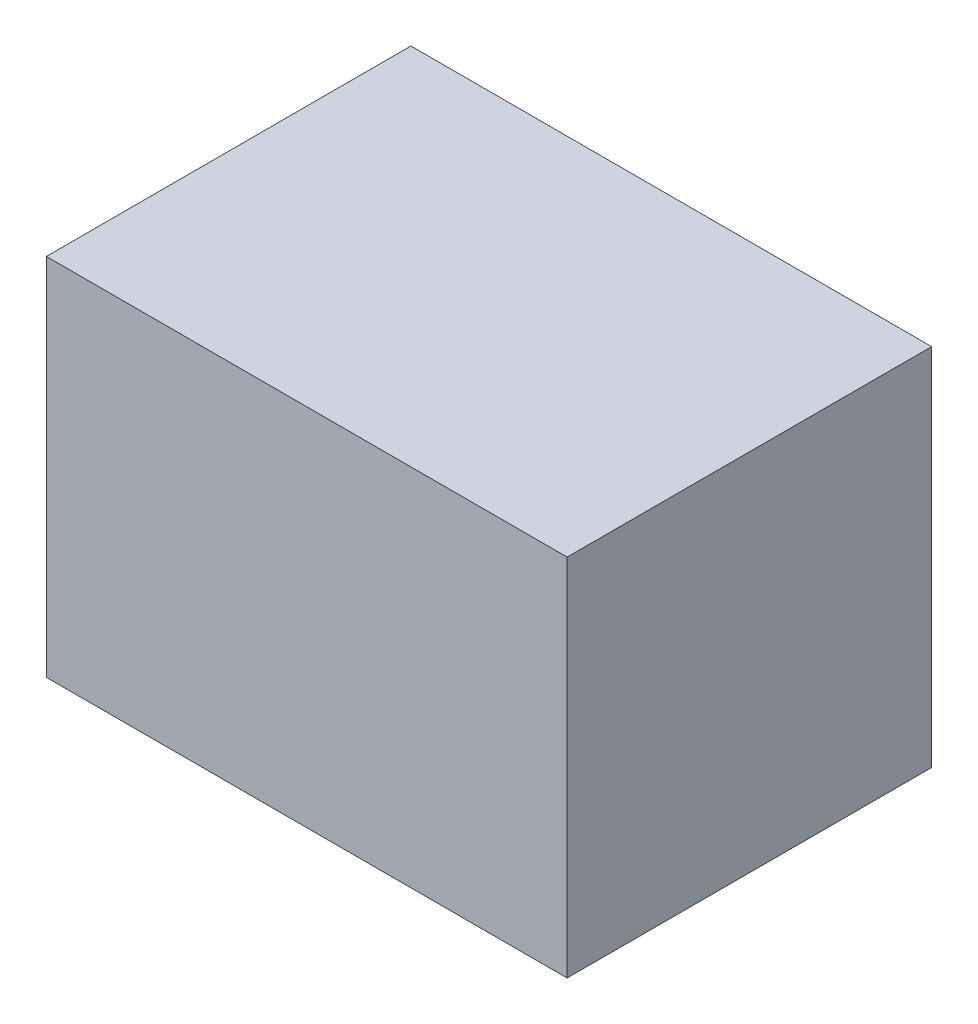
ISO-10303-21;
HEADER;
FILE_DESCRIPTION(('STEP AP214'),'2;1');
FILE_NAME('part.step','',(''),(''),'','','');
FILE_SCHEMA(('AUTOMOTIVE_DESIGN { 1 0 10303 214 1 1 1 1 }'));
ENDSEC;
DATA;
#1=APPLICATION_CONTEXT('core data for automotive mechanical design processes');
#2=APPLICATION_PROTOCOL_DEFINITION('international standard','automotive_design',2000,#1);
#3=PRODUCT_CONTEXT('',#1,'mechanical');
#4=PRODUCT('Part','Part','',(#3));
#5=PRODUCT_RELATED_PRODUCT_CATEGORY('part','',(#4));
#6=PRODUCT_DEFINITION_FORMATION('','',#4);
#7=PRODUCT_DEFINITION_CONTEXT('part definition',#1,'design');
#8=PRODUCT_DEFINITION('design','',#6,#7);
#9=PRODUCT_DEFINITION_SHAPE('','',#8);
#10=(LENGTH_UNIT() NAMED_UNIT(*) SI_UNIT(.MILLI.,.METRE.));
#11=(NAMED_UNIT(*) PLANE_ANGLE_UNIT() SI_UNIT($,.RADIAN.));
#12=(NAMED_UNIT(*) SI_UNIT($,.STERADIAN.) SOLID_ANGLE_UNIT());
#13=UNCERTAINTY_MEASURE_WITH_UNIT(LENGTH_MEASURE(1.E-05),#10,'distance_accuracy_value','');
#14=(GEOMETRIC_REPRESENTATION_CONTEXT(3) GLOBAL_UNCERTAINTY_ASSIGNED_CONTEXT((#13)) GLOBAL_UNIT_ASSIGNED_CONTEXT((#10,
#11,#12)) REPRESENTATION_CONTEXT('',''));
#15=CARTESIAN_POINT('',(0.,0.,0.));
#16=DIRECTION('',(0.,0.,1.));
#17=DIRECTION('',(1.,0.,0.));
#18=AXIS2_PLACEMENT_3D('',#15,#16,#17);
#19=CARTESIAN_POINT('',(-7.62,0.,0.));
#20=DIRECTION('',(0.,1.,0.));
#21=DIRECTION('',(1.,0.,0.));
#22=AXIS2_PLACEMENT_3D('',#19,#20,#21);
#23=PLANE('',#22);
#24=DIRECTION('',(0.,0.,1.));
#25=VECTOR('',#24,1.);
#26=CARTESIAN_POINT('',(7.37,0.,0.749999999999982));
#27=LINE('',#26,#25);
#28=CARTESIAN_POINT('',(7.37,0.,0.749999999999982));
#29=VERTEX_POINT('',#28);
#30=CARTESIAN_POINT('',(7.37,0.,1.1));
#31=VERTEX_POINT('',#30);
#32=EDGE_CURVE('E85',#29,#31,#27,.T.);
#33=ORIENTED_EDGE('',*,*,#32,.T.);
#34=DIRECTION('',(1.,0.,0.));
#35=VECTOR('',#34,1.);
#36=CARTESIAN_POINT('',(7.37,0.,1.1));
#37=LINE('',#36,#35);
#38=CARTESIAN_POINT('',(7.87,0.,1.1));
#39=VERTEX_POINT('',#38);
#40=EDGE_CURVE('E27',#31,#39,#37,.T.);
#41=ORIENTED_EDGE('',*,*,#40,.T.);
#42=DIRECTION('',(0.,0.,1.));
#43=VECTOR('',#42,1.);
#44=CARTESIAN_POINT('',(7.87,0.,0.749999999999982));
#45=LINE('',#44,#43);
#46=CARTESIAN_POINT('',(7.87,0.,0.749999999999982));
#47=VERTEX_POINT('',#46);
#48=EDGE_CURVE('E72',#47,#39,#45,.T.);
#49=ORIENTED_EDGE('',*,*,#48,.F.);
#50=DIRECTION('',(1.,0.,0.));
#51=VECTOR('',#50,1.);
#52=CARTESIAN_POINT('',(7.37,0.,0.749999999999982));
#53=LINE('',#52,#51);
#54=EDGE_CURVE('E82',#29,#47,#53,.T.);
#55=ORIENTED_EDGE('',*,*,#54,.F.);
#56=EDGE_LOOP('',(#33,#41,#49,#55));
#57=FACE_BOUND('',#56,.T.);
#58=ADVANCED_FACE('F16',(#57),#23,.T.);
#59=CARTESIAN_POINT('',(-7.62,-0.35,0.));
#60=DIRECTION('',(0.,1.,0.));
#61=DIRECTION('',(1.,0.,0.));
#62=AXIS2_PLACEMENT_3D('',#59,#60,#61);
#63=PLANE('',#62);
#64=DIRECTION('',(0.,0.,1.));
#65=VECTOR('',#64,1.);
#66=CARTESIAN_POINT('',(7.37,-0.35,0.749999999999982));
#67=LINE('',#66,#65);
#68=CARTESIAN_POINT('',(7.37,-0.35,0.749999999999982));
#69=VERTEX_POINT('',#68);
#70=CARTESIAN_POINT('',(7.37,-0.35,1.1));
#71=VERTEX_POINT('',#70);
#72=EDGE_CURVE('E20',#69,#71,#67,.T.);
#73=ORIENTED_EDGE('',*,*,#72,.F.);
#74=DIRECTION('',(1.,0.,0.));
#75=VECTOR('',#74,1.);
#76=CARTESIAN_POINT('',(7.37,-0.35,0.749999999999982));
#77=LINE('',#76,#75);
#78=CARTESIAN_POINT('',(7.87,-0.35,0.749999999999982));
#79=VERTEX_POINT('',#78);
#80=EDGE_CURVE('E95',#69,#79,#77,.T.);
#81=ORIENTED_EDGE('',*,*,#80,.T.);
#82=DIRECTION('',(0.,0.,1.));
#83=VECTOR('',#82,1.);
#84=CARTESIAN_POINT('',(7.87,-0.35,0.749999999999982));
#85=LINE('',#84,#83);
#86=CARTESIAN_POINT('',(7.87,-0.35,1.1));
#87=VERTEX_POINT('',#86);
#88=EDGE_CURVE('E60',#79,#87,#85,.T.);
#89=ORIENTED_EDGE('',*,*,#88,.T.);
#90=DIRECTION('',(1.,0.,0.));
#91=VECTOR('',#90,1.);
#92=CARTESIAN_POINT('',(7.37,-0.35,1.1));
#93=LINE('',#92,#91);
#94=EDGE_CURVE('E11',#71,#87,#93,.T.);
#95=ORIENTED_EDGE('',*,*,#94,.F.);
#96=EDGE_LOOP('',(#73,#81,#89,#95));
#97=FACE_BOUND('',#96,.T.);
#98=ADVANCED_FACE('F130',(#97),#63,.F.);
#99=CARTESIAN_POINT('',(7.37,-0.35,1.1));
#100=DIRECTION('',(0.,0.,1.));
#101=DIRECTION('',(1.,0.,0.));
#102=AXIS2_PLACEMENT_3D('',#99,#100,#101);
#103=PLANE('',#102);
#104=ORIENTED_EDGE('',*,*,#40,.F.);
#105=DIRECTION('',(0.,1.,0.));
#106=VECTOR('',#105,1.);
#107=CARTESIAN_POINT('',(7.37,-0.35,1.1));
#108=LINE('',#107,#106);
#109=EDGE_CURVE('E90',#71,#31,#108,.T.);
#110=ORIENTED_EDGE('',*,*,#109,.F.);
#111=ORIENTED_EDGE('',*,*,#94,.T.);
#112=DIRECTION('',(0.,1.,0.));
#113=VECTOR('',#112,1.);
#114=CARTESIAN_POINT('',(7.87,-0.35,1.1));
#115=LINE('',#114,#113);
#116=EDGE_CURVE('E109',#87,#39,#115,.T.);
#117=ORIENTED_EDGE('',*,*,#116,.T.);
#118=EDGE_LOOP('',(#104,#110,#111,#117));
#119=FACE_BOUND('',#118,.T.);
#120=ADVANCED_FACE('F154',(#119),#103,.T.);
#121=CARTESIAN_POINT('',(7.87,-0.35,0.749999999999982));
#122=DIRECTION('',(-1.,0.,0.));
#123=DIRECTION('',(0.,0.,1.));
#124=AXIS2_PLACEMENT_3D('',#121,#122,#123);
#125=PLANE('',#124);
#126=ORIENTED_EDGE('',*,*,#48,.T.);
#127=ORIENTED_EDGE('',*,*,#116,.F.);
#128=ORIENTED_EDGE('',*,*,#88,.F.);
#129=DIRECTION('',(0.,1.,0.));
#130=VECTOR('',#129,1.);
#131=CARTESIAN_POINT('',(7.87,-0.35,0.749999999999982));
#132=LINE('',#131,#130);
#133=EDGE_CURVE('E89',#79,#47,#132,.T.);
#134=ORIENTED_EDGE('',*,*,#133,.T.);
#135=EDGE_LOOP('',(#126,#127,#128,#134));
#136=FACE_BOUND('',#135,.T.);
#137=ADVANCED_FACE('F18',(#136),#125,.F.);
#138=CARTESIAN_POINT('',(7.37,-0.35,0.749999999999982));
#139=DIRECTION('',(0.,0.,1.));
#140=DIRECTION('',(1.,0.,0.));
#141=AXIS2_PLACEMENT_3D('',#138,#139,#140);
#142=PLANE('',#141);
#143=ORIENTED_EDGE('',*,*,#54,.T.);
#144=ORIENTED_EDGE('',*,*,#133,.F.);
#145=ORIENTED_EDGE('',*,*,#80,.F.);
#146=DIRECTION('',(0.,1.,0.));
#147=VECTOR('',#146,1.);
#148=CARTESIAN_POINT('',(7.37,-0.35,0.749999999999982));
#149=LINE('',#148,#147);
#150=EDGE_CURVE('E93',#69,#29,#149,.T.);
#151=ORIENTED_EDGE('',*,*,#150,.T.);
#152=EDGE_LOOP('',(#143,#144,#145,#151));
#153=FACE_BOUND('',#152,.T.);
#154=ADVANCED_FACE('F94',(#153),#142,.F.);
#155=CARTESIAN_POINT('',(7.37,-0.35,0.749999999999982));
#156=DIRECTION('',(-1.,0.,0.));
#157=DIRECTION('',(0.,0.,1.));
#158=AXIS2_PLACEMENT_3D('',#155,#156,#157);
#159=PLANE('',#158);
#160=ORIENTED_EDGE('',*,*,#32,.F.);
#161=ORIENTED_EDGE('',*,*,#150,.F.);
#162=ORIENTED_EDGE('',*,*,#72,.T.);
#163=ORIENTED_EDGE('',*,*,#109,.T.);
#164=EDGE_LOOP('',(#160,#161,#162,#163));
#165=FACE_BOUND('',#164,.T.);
#166=ADVANCED_FACE('F101',(#165),#159,.T.);
#167=CLOSED_SHELL('',(#58,#98,#120,#137,#154,#166));
#168=MANIFOLD_SOLID_BREP('B1',#167);
#169=ADVANCED_BREP_SHAPE_REPRESENTATION('',(#18,#168),#14);
#170=SHAPE_DEFINITION_REPRESENTATION(#9,#169);
ENDSEC;
END-ISO-10303-21;
